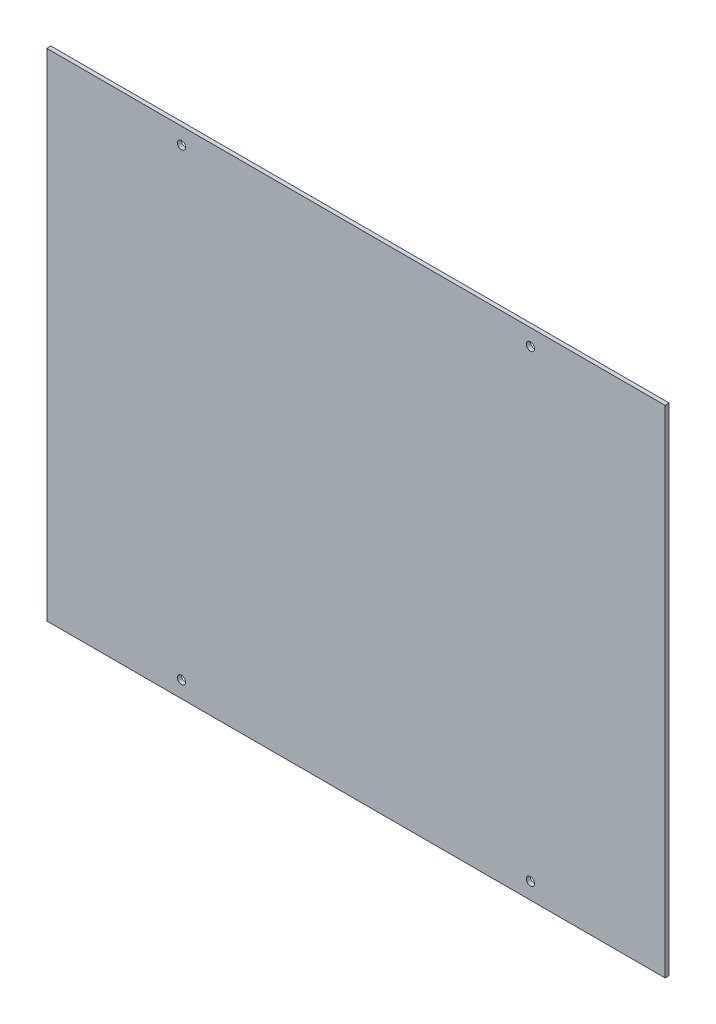
ISO-10303-21;
HEADER;
FILE_DESCRIPTION(('STEP AP214'),'2;1');
FILE_NAME('part.step','',(''),(''),'','','');
FILE_SCHEMA(('AUTOMOTIVE_DESIGN { 1 0 10303 214 1 1 1 1 }'));
ENDSEC;
DATA;
#1=APPLICATION_CONTEXT('core data for automotive mechanical design processes');
#2=APPLICATION_PROTOCOL_DEFINITION('international standard','automotive_design',2000,#1);
#3=PRODUCT_CONTEXT('',#1,'mechanical');
#4=PRODUCT('Part','Part','',(#3));
#5=PRODUCT_RELATED_PRODUCT_CATEGORY('part','',(#4));
#6=PRODUCT_DEFINITION_FORMATION('','',#4);
#7=PRODUCT_DEFINITION_CONTEXT('part definition',#1,'design');
#8=PRODUCT_DEFINITION('design','',#6,#7);
#9=PRODUCT_DEFINITION_SHAPE('','',#8);
#10=(LENGTH_UNIT() NAMED_UNIT(*) SI_UNIT(.MILLI.,.METRE.));
#11=(NAMED_UNIT(*) PLANE_ANGLE_UNIT() SI_UNIT($,.RADIAN.));
#12=(NAMED_UNIT(*) SI_UNIT($,.STERADIAN.) SOLID_ANGLE_UNIT());
#13=UNCERTAINTY_MEASURE_WITH_UNIT(LENGTH_MEASURE(1.E-05),#10,'distance_accuracy_value','');
#14=(GEOMETRIC_REPRESENTATION_CONTEXT(3) GLOBAL_UNCERTAINTY_ASSIGNED_CONTEXT((#13)) GLOBAL_UNIT_ASSIGNED_CONTEXT((#10,
#11,#12)) REPRESENTATION_CONTEXT('',''));
#15=CARTESIAN_POINT('',(0.,0.,0.));
#16=DIRECTION('',(0.,0.,1.));
#17=DIRECTION('',(1.,0.,0.));
#18=AXIS2_PLACEMENT_3D('',#15,#16,#17);
#19=CARTESIAN_POINT('',(0.,0.,2.));
#20=DIRECTION('',(0.,0.,1.));
#21=DIRECTION('',(1.,0.,0.));
#22=AXIS2_PLACEMENT_3D('',#19,#20,#21);
#23=PLANE('',#22);
#24=CARTESIAN_POINT('',(85.4999999999999,-113.480198019802,2.));
#25=DIRECTION('',(0.,0.,1.));
#26=DIRECTION('',(-1.,0.,0.));
#27=AXIS2_PLACEMENT_3D('',#24,#25,#26);
#28=CIRCLE('',#27,2.00000000000001);
#29=CARTESIAN_POINT('',(83.4999999999999,-113.480198019802,2.));
#30=VERTEX_POINT('',#29);
#31=EDGE_CURVE('E152',#30,#30,#28,.T.);
#32=ORIENTED_EDGE('',*,*,#31,.F.);
#33=EDGE_LOOP('',(#32));
#34=FACE_BOUND('',#33,.T.);
#35=CARTESIAN_POINT('',(-85.5,113.480198019802,2.));
#36=DIRECTION('',(0.,0.,1.));
#37=DIRECTION('',(1.,0.,0.));
#38=AXIS2_PLACEMENT_3D('',#35,#36,#37);
#39=CIRCLE('',#38,2.00000000000001);
#40=CARTESIAN_POINT('',(-83.5,113.480198019802,2.));
#41=VERTEX_POINT('',#40);
#42=EDGE_CURVE('E123',#41,#41,#39,.T.);
#43=ORIENTED_EDGE('',*,*,#42,.F.);
#44=EDGE_LOOP('',(#43));
#45=FACE_BOUND('',#44,.T.);
#46=DIRECTION('',(0.,-1.,0.));
#47=VECTOR('',#46,1.);
#48=CARTESIAN_POINT('',(-151.5,-121.5,2.));
#49=LINE('',#48,#47);
#50=CARTESIAN_POINT('',(-151.5,121.5,2.));
#51=VERTEX_POINT('',#50);
#52=CARTESIAN_POINT('',(-151.5,-121.5,2.));
#53=VERTEX_POINT('',#52);
#54=EDGE_CURVE('E102',#51,#53,#49,.T.);
#55=ORIENTED_EDGE('',*,*,#54,.T.);
#56=DIRECTION('',(1.,0.,0.));
#57=VECTOR('',#56,1.);
#58=CARTESIAN_POINT('',(151.5,-121.5,2.));
#59=LINE('',#58,#57);
#60=CARTESIAN_POINT('',(151.5,-121.5,2.));
#61=VERTEX_POINT('',#60);
#62=EDGE_CURVE('E97',#53,#61,#59,.T.);
#63=ORIENTED_EDGE('',*,*,#62,.T.);
#64=DIRECTION('',(0.,1.,0.));
#65=VECTOR('',#64,1.);
#66=CARTESIAN_POINT('',(151.5,-121.5,2.));
#67=LINE('',#66,#65);
#68=CARTESIAN_POINT('',(151.5,121.5,2.));
#69=VERTEX_POINT('',#68);
#70=EDGE_CURVE('E100',#61,#69,#67,.T.);
#71=ORIENTED_EDGE('',*,*,#70,.T.);
#72=DIRECTION('',(-1.,0.,0.));
#73=VECTOR('',#72,1.);
#74=CARTESIAN_POINT('',(151.5,121.5,2.));
#75=LINE('',#74,#73);
#76=EDGE_CURVE('E61',#69,#51,#75,.T.);
#77=ORIENTED_EDGE('',*,*,#76,.T.);
#78=EDGE_LOOP('',(#55,#63,#71,#77));
#79=FACE_BOUND('',#78,.T.);
#80=CARTESIAN_POINT('',(85.5,113.480198019802,2.));
#81=DIRECTION('',(0.,0.,1.));
#82=DIRECTION('',(1.,0.,0.));
#83=AXIS2_PLACEMENT_3D('',#80,#81,#82);
#84=CIRCLE('',#83,2.00000000000001);
#85=CARTESIAN_POINT('',(87.5,113.480198019802,2.));
#86=VERTEX_POINT('',#85);
#87=EDGE_CURVE('E145',#86,#86,#84,.T.);
#88=ORIENTED_EDGE('',*,*,#87,.F.);
#89=EDGE_LOOP('',(#88));
#90=FACE_BOUND('',#89,.T.);
#91=CARTESIAN_POINT('',(-85.5,-113.480198019802,2.));
#92=DIRECTION('',(0.,0.,1.));
#93=DIRECTION('',(-1.,0.,0.));
#94=AXIS2_PLACEMENT_3D('',#91,#92,#93);
#95=CIRCLE('',#94,2.00000000000001);
#96=CARTESIAN_POINT('',(-87.5,-113.480198019802,2.));
#97=VERTEX_POINT('',#96);
#98=EDGE_CURVE('E160',#97,#97,#95,.T.);
#99=ORIENTED_EDGE('',*,*,#98,.F.);
#100=EDGE_LOOP('',(#99));
#101=FACE_BOUND('',#100,.T.);
#102=ADVANCED_FACE('F41',(#34,#45,#79,#90,#101),#23,.T.);
#103=CARTESIAN_POINT('',(0.,0.,0.));
#104=DIRECTION('',(0.,0.,1.));
#105=DIRECTION('',(1.,0.,0.));
#106=AXIS2_PLACEMENT_3D('',#103,#104,#105);
#107=PLANE('',#106);
#108=DIRECTION('',(0.,-1.,0.));
#109=VECTOR('',#108,1.);
#110=CARTESIAN_POINT('',(-151.5,-121.5,0.));
#111=LINE('',#110,#109);
#112=CARTESIAN_POINT('',(-151.5,121.5,0.));
#113=VERTEX_POINT('',#112);
#114=CARTESIAN_POINT('',(-151.5,-121.5,0.));
#115=VERTEX_POINT('',#114);
#116=EDGE_CURVE('E119',#113,#115,#111,.T.);
#117=ORIENTED_EDGE('',*,*,#116,.F.);
#118=DIRECTION('',(-1.,0.,0.));
#119=VECTOR('',#118,1.);
#120=CARTESIAN_POINT('',(151.5,121.5,0.));
#121=LINE('',#120,#119);
#122=CARTESIAN_POINT('',(151.5,121.5,0.));
#123=VERTEX_POINT('',#122);
#124=EDGE_CURVE('E89',#123,#113,#121,.T.);
#125=ORIENTED_EDGE('',*,*,#124,.F.);
#126=DIRECTION('',(0.,1.,0.));
#127=VECTOR('',#126,1.);
#128=CARTESIAN_POINT('',(151.5,-121.5,0.));
#129=LINE('',#128,#127);
#130=CARTESIAN_POINT('',(151.5,-121.5,0.));
#131=VERTEX_POINT('',#130);
#132=EDGE_CURVE('E83',#131,#123,#129,.T.);
#133=ORIENTED_EDGE('',*,*,#132,.F.);
#134=DIRECTION('',(1.,0.,0.));
#135=VECTOR('',#134,1.);
#136=CARTESIAN_POINT('',(151.5,-121.5,0.));
#137=LINE('',#136,#135);
#138=EDGE_CURVE('E107',#115,#131,#137,.T.);
#139=ORIENTED_EDGE('',*,*,#138,.F.);
#140=EDGE_LOOP('',(#117,#125,#133,#139));
#141=FACE_BOUND('',#140,.T.);
#142=CARTESIAN_POINT('',(-85.5,113.480198019802,0.));
#143=DIRECTION('',(0.,0.,1.));
#144=DIRECTION('',(1.,0.,0.));
#145=AXIS2_PLACEMENT_3D('',#142,#143,#144);
#146=CIRCLE('',#145,2.00000000000001);
#147=CARTESIAN_POINT('',(-83.5,113.480198019802,0.));
#148=VERTEX_POINT('',#147);
#149=EDGE_CURVE('E141',#148,#148,#146,.T.);
#150=ORIENTED_EDGE('',*,*,#149,.T.);
#151=EDGE_LOOP('',(#150));
#152=FACE_BOUND('',#151,.T.);
#153=CARTESIAN_POINT('',(85.5,113.480198019802,0.));
#154=DIRECTION('',(0.,0.,1.));
#155=DIRECTION('',(1.,0.,0.));
#156=AXIS2_PLACEMENT_3D('',#153,#154,#155);
#157=CIRCLE('',#156,2.00000000000001);
#158=CARTESIAN_POINT('',(87.5,113.480198019802,0.));
#159=VERTEX_POINT('',#158);
#160=EDGE_CURVE('E148',#159,#159,#157,.T.);
#161=ORIENTED_EDGE('',*,*,#160,.T.);
#162=EDGE_LOOP('',(#161));
#163=FACE_BOUND('',#162,.T.);
#164=CARTESIAN_POINT('',(85.4999999999999,-113.480198019802,0.));
#165=DIRECTION('',(0.,0.,1.));
#166=DIRECTION('',(-1.,0.,0.));
#167=AXIS2_PLACEMENT_3D('',#164,#165,#166);
#168=CIRCLE('',#167,2.00000000000001);
#169=CARTESIAN_POINT('',(83.4999999999999,-113.480198019802,0.));
#170=VERTEX_POINT('',#169);
#171=EDGE_CURVE('E156',#170,#170,#168,.T.);
#172=ORIENTED_EDGE('',*,*,#171,.T.);
#173=EDGE_LOOP('',(#172));
#174=FACE_BOUND('',#173,.T.);
#175=CARTESIAN_POINT('',(-85.5,-113.480198019802,0.));
#176=DIRECTION('',(0.,0.,1.));
#177=DIRECTION('',(-1.,0.,0.));
#178=AXIS2_PLACEMENT_3D('',#175,#176,#177);
#179=CIRCLE('',#178,2.00000000000001);
#180=CARTESIAN_POINT('',(-87.5,-113.480198019802,0.));
#181=VERTEX_POINT('',#180);
#182=EDGE_CURVE('E164',#181,#181,#179,.T.);
#183=ORIENTED_EDGE('',*,*,#182,.T.);
#184=EDGE_LOOP('',(#183));
#185=FACE_BOUND('',#184,.T.);
#186=ADVANCED_FACE('F136',(#141,#152,#163,#174,#185),#107,.F.);
#187=CARTESIAN_POINT('',(-151.5,-121.5,2.));
#188=DIRECTION('',(1.,0.,0.));
#189=DIRECTION('',(0.,0.,-1.));
#190=AXIS2_PLACEMENT_3D('',#187,#188,#189);
#191=PLANE('',#190);
#192=ORIENTED_EDGE('',*,*,#116,.T.);
#193=DIRECTION('',(0.,0.,-1.));
#194=VECTOR('',#193,1.);
#195=CARTESIAN_POINT('',(-151.5,-121.5,2.));
#196=LINE('',#195,#194);
#197=EDGE_CURVE('E11',#53,#115,#196,.T.);
#198=ORIENTED_EDGE('',*,*,#197,.F.);
#199=ORIENTED_EDGE('',*,*,#54,.F.);
#200=DIRECTION('',(0.,0.,-1.));
#201=VECTOR('',#200,1.);
#202=CARTESIAN_POINT('',(-151.5,121.5,2.));
#203=LINE('',#202,#201);
#204=EDGE_CURVE('E115',#51,#113,#203,.T.);
#205=ORIENTED_EDGE('',*,*,#204,.T.);
#206=EDGE_LOOP('',(#192,#198,#199,#205));
#207=FACE_BOUND('',#206,.T.);
#208=ADVANCED_FACE('F43',(#207),#191,.F.);
#209=CARTESIAN_POINT('',(151.5,-121.5,2.));
#210=DIRECTION('',(0.,1.,0.));
#211=DIRECTION('',(-1.,0.,0.));
#212=AXIS2_PLACEMENT_3D('',#209,#210,#211);
#213=PLANE('',#212);
#214=ORIENTED_EDGE('',*,*,#138,.T.);
#215=DIRECTION('',(0.,0.,-1.));
#216=VECTOR('',#215,1.);
#217=CARTESIAN_POINT('',(151.5,-121.5,2.));
#218=LINE('',#217,#216);
#219=EDGE_CURVE('E51',#61,#131,#218,.T.);
#220=ORIENTED_EDGE('',*,*,#219,.F.);
#221=ORIENTED_EDGE('',*,*,#62,.F.);
#222=ORIENTED_EDGE('',*,*,#197,.T.);
#223=EDGE_LOOP('',(#214,#220,#221,#222));
#224=FACE_BOUND('',#223,.T.);
#225=ADVANCED_FACE('F106',(#224),#213,.F.);
#226=CARTESIAN_POINT('',(151.5,-121.5,2.));
#227=DIRECTION('',(-1.,0.,0.));
#228=DIRECTION('',(0.,0.,1.));
#229=AXIS2_PLACEMENT_3D('',#226,#227,#228);
#230=PLANE('',#229);
#231=ORIENTED_EDGE('',*,*,#132,.T.);
#232=DIRECTION('',(0.,0.,-1.));
#233=VECTOR('',#232,1.);
#234=CARTESIAN_POINT('',(151.5,121.5,2.));
#235=LINE('',#234,#233);
#236=EDGE_CURVE('E109',#69,#123,#235,.T.);
#237=ORIENTED_EDGE('',*,*,#236,.F.);
#238=ORIENTED_EDGE('',*,*,#70,.F.);
#239=ORIENTED_EDGE('',*,*,#219,.T.);
#240=EDGE_LOOP('',(#231,#237,#238,#239));
#241=FACE_BOUND('',#240,.T.);
#242=ADVANCED_FACE('F110',(#241),#230,.F.);
#243=CARTESIAN_POINT('',(151.5,121.5,2.));
#244=DIRECTION('',(0.,-1.,0.));
#245=DIRECTION('',(0.,0.,-1.));
#246=AXIS2_PLACEMENT_3D('',#243,#244,#245);
#247=PLANE('',#246);
#248=ORIENTED_EDGE('',*,*,#124,.T.);
#249=ORIENTED_EDGE('',*,*,#204,.F.);
#250=ORIENTED_EDGE('',*,*,#76,.F.);
#251=ORIENTED_EDGE('',*,*,#236,.T.);
#252=EDGE_LOOP('',(#248,#249,#250,#251));
#253=FACE_BOUND('',#252,.T.);
#254=ADVANCED_FACE('F133',(#253),#247,.F.);
#255=CARTESIAN_POINT('',(-85.5,113.480198019802,2.));
#256=DIRECTION('',(0.,0.,-1.));
#257=DIRECTION('',(-1.,0.,0.));
#258=AXIS2_PLACEMENT_3D('',#255,#256,#257);
#259=CYLINDRICAL_SURFACE('',#258,2.00000000000001);
#260=ORIENTED_EDGE('',*,*,#42,.T.);
#261=EDGE_LOOP('',(#260));
#262=FACE_BOUND('',#261,.T.);
#263=ORIENTED_EDGE('',*,*,#149,.F.);
#264=EDGE_LOOP('',(#263));
#265=FACE_BOUND('',#264,.T.);
#266=ADVANCED_FACE('F185',(#262,#265),#259,.F.);
#267=CARTESIAN_POINT('',(85.5,113.480198019802,2.));
#268=DIRECTION('',(0.,0.,-1.));
#269=DIRECTION('',(-1.,0.,0.));
#270=AXIS2_PLACEMENT_3D('',#267,#268,#269);
#271=CYLINDRICAL_SURFACE('',#270,2.00000000000001);
#272=ORIENTED_EDGE('',*,*,#87,.T.);
#273=EDGE_LOOP('',(#272));
#274=FACE_BOUND('',#273,.T.);
#275=ORIENTED_EDGE('',*,*,#160,.F.);
#276=EDGE_LOOP('',(#275));
#277=FACE_BOUND('',#276,.T.);
#278=ADVANCED_FACE('F217',(#274,#277),#271,.F.);
#279=CARTESIAN_POINT('',(85.4999999999999,-113.480198019802,2.));
#280=DIRECTION('',(0.,0.,-1.));
#281=DIRECTION('',(-1.,0.,0.));
#282=AXIS2_PLACEMENT_3D('',#279,#280,#281);
#283=CYLINDRICAL_SURFACE('',#282,2.00000000000001);
#284=ORIENTED_EDGE('',*,*,#31,.T.);
#285=EDGE_LOOP('',(#284));
#286=FACE_BOUND('',#285,.T.);
#287=ORIENTED_EDGE('',*,*,#171,.F.);
#288=EDGE_LOOP('',(#287));
#289=FACE_BOUND('',#288,.T.);
#290=ADVANCED_FACE('F224',(#286,#289),#283,.F.);
#291=CARTESIAN_POINT('',(-85.5,-113.480198019802,2.));
#292=DIRECTION('',(0.,0.,-1.));
#293=DIRECTION('',(-1.,0.,0.));
#294=AXIS2_PLACEMENT_3D('',#291,#292,#293);
#295=CYLINDRICAL_SURFACE('',#294,2.00000000000001);
#296=ORIENTED_EDGE('',*,*,#98,.T.);
#297=EDGE_LOOP('',(#296));
#298=FACE_BOUND('',#297,.T.);
#299=ORIENTED_EDGE('',*,*,#182,.F.);
#300=EDGE_LOOP('',(#299));
#301=FACE_BOUND('',#300,.T.);
#302=ADVANCED_FACE('F172',(#298,#301),#295,.F.);
#303=CLOSED_SHELL('',(#102,#186,#208,#225,#242,#254,#266,#278,#290,#302));
#304=MANIFOLD_SOLID_BREP('B2',#303);
#305=ADVANCED_BREP_SHAPE_REPRESENTATION('',(#18,#304),#14);
#306=SHAPE_DEFINITION_REPRESENTATION(#9,#305);
ENDSEC;
END-ISO-10303-21;
